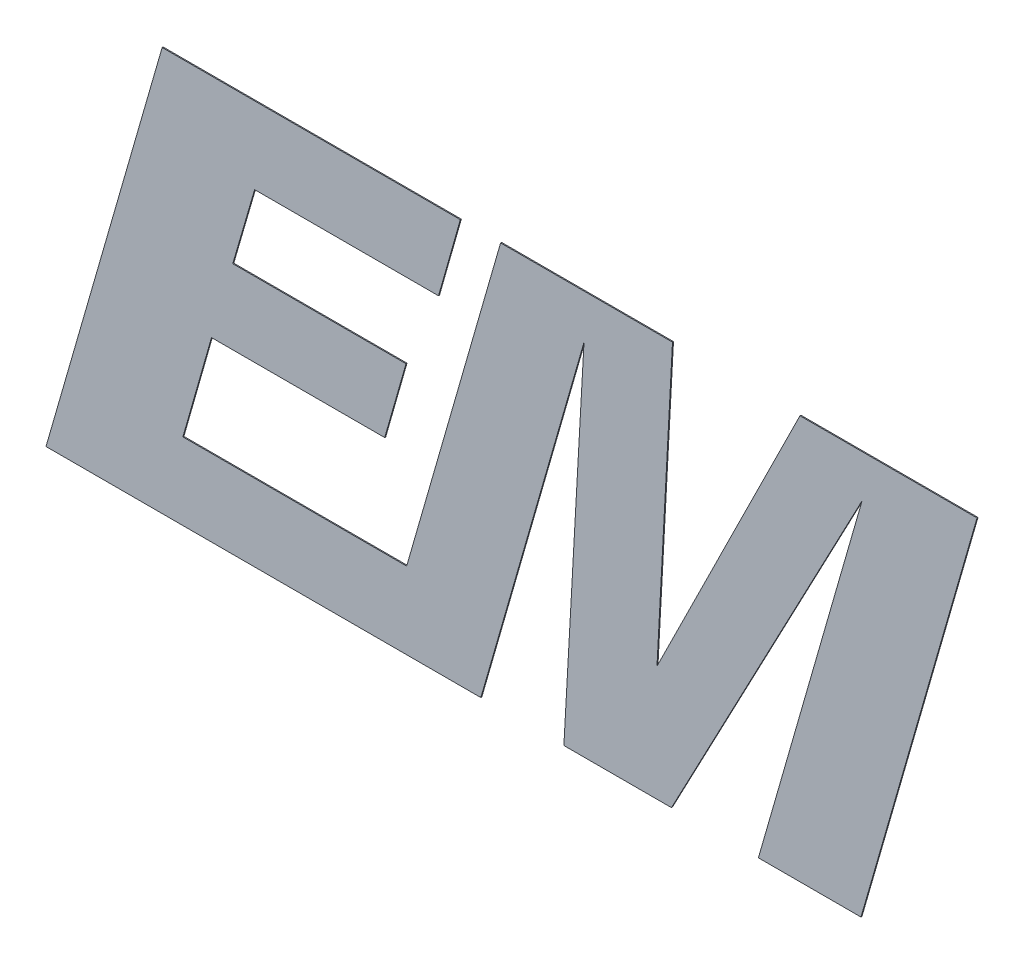
ISO-10303-21;
HEADER;
FILE_DESCRIPTION(('STEP AP214'),'2;1');
FILE_NAME('part.step','',(''),(''),'','','');
FILE_SCHEMA(('AUTOMOTIVE_DESIGN { 1 0 10303 214 1 1 1 1 }'));
ENDSEC;
DATA;
#1=APPLICATION_CONTEXT('core data for automotive mechanical design processes');
#2=APPLICATION_PROTOCOL_DEFINITION('international standard','automotive_design',2000,#1);
#3=PRODUCT_CONTEXT('',#1,'mechanical');
#4=PRODUCT('Part','Part','',(#3));
#5=PRODUCT_RELATED_PRODUCT_CATEGORY('part','',(#4));
#6=PRODUCT_DEFINITION_FORMATION('','',#4);
#7=PRODUCT_DEFINITION_CONTEXT('part definition',#1,'design');
#8=PRODUCT_DEFINITION('design','',#6,#7);
#9=PRODUCT_DEFINITION_SHAPE('','',#8);
#10=(LENGTH_UNIT() NAMED_UNIT(*) SI_UNIT(.MILLI.,.METRE.));
#11=(NAMED_UNIT(*) PLANE_ANGLE_UNIT() SI_UNIT($,.RADIAN.));
#12=(NAMED_UNIT(*) SI_UNIT($,.STERADIAN.) SOLID_ANGLE_UNIT());
#13=UNCERTAINTY_MEASURE_WITH_UNIT(LENGTH_MEASURE(1.E-05),#10,'distance_accuracy_value','');
#14=(GEOMETRIC_REPRESENTATION_CONTEXT(3) GLOBAL_UNCERTAINTY_ASSIGNED_CONTEXT((#13)) GLOBAL_UNIT_ASSIGNED_CONTEXT((#10,
#11,#12)) REPRESENTATION_CONTEXT('',''));
#15=CARTESIAN_POINT('',(0.,0.,0.));
#16=DIRECTION('',(0.,0.,1.));
#17=DIRECTION('',(1.,0.,0.));
#18=AXIS2_PLACEMENT_3D('',#15,#16,#17);
#19=CARTESIAN_POINT('',(10.8469375416372,6.82608440985244,5.205));
#20=DIRECTION('',(0.,-1.,0.));
#21=DIRECTION('',(0.,0.,-1.));
#22=AXIS2_PLACEMENT_3D('',#19,#20,#21);
#23=PLANE('',#22);
#24=DIRECTION('',(-1.,0.,0.));
#25=VECTOR('',#24,1.);
#26=CARTESIAN_POINT('',(10.8469375416372,6.82608440985244,5.2));
#27=LINE('',#26,#25);
#28=CARTESIAN_POINT('',(10.8469375416372,6.82608440985244,5.2));
#29=VERTEX_POINT('',#28);
#30=CARTESIAN_POINT('',(9.94792919842269,6.82608440985244,5.2));
#31=VERTEX_POINT('',#30);
#32=EDGE_CURVE('E11',#29,#31,#27,.T.);
#33=ORIENTED_EDGE('',*,*,#32,.T.);
#34=DIRECTION('',(0.,0.,-1.));
#35=VECTOR('',#34,1.);
#36=CARTESIAN_POINT('',(9.94792919842269,6.82608440985244,5.205));
#37=LINE('',#36,#35);
#38=CARTESIAN_POINT('',(9.94792919842269,6.82608440985244,5.205));
#39=VERTEX_POINT('',#38);
#40=EDGE_CURVE('E43',#39,#31,#37,.T.);
#41=ORIENTED_EDGE('',*,*,#40,.F.);
#42=DIRECTION('',(-1.,0.,0.));
#43=VECTOR('',#42,1.);
#44=CARTESIAN_POINT('',(10.8469375416372,6.82608440985244,5.205));
#45=LINE('',#44,#43);
#46=CARTESIAN_POINT('',(10.8469375416372,6.82608440985244,5.205));
#47=VERTEX_POINT('',#46);
#48=EDGE_CURVE('E352',#47,#39,#45,.T.);
#49=ORIENTED_EDGE('',*,*,#48,.F.);
#50=DIRECTION('',(0.,0.,-1.));
#51=VECTOR('',#50,1.);
#52=CARTESIAN_POINT('',(10.8469375416372,6.82608440985244,5.205));
#53=LINE('',#52,#51);
#54=EDGE_CURVE('E28',#47,#29,#53,.T.);
#55=ORIENTED_EDGE('',*,*,#54,.T.);
#56=EDGE_LOOP('',(#33,#41,#49,#55));
#57=FACE_BOUND('',#56,.T.);
#58=ADVANCED_FACE('F17',(#57),#23,.F.);
#59=CARTESIAN_POINT('',(9.94792919842269,6.82608440985244,5.205));
#60=DIRECTION('',(0.89586763618268,-0.444321030832952,0.));
#61=DIRECTION('',(0.,0.,-1.));
#62=AXIS2_PLACEMENT_3D('',#59,#60,#61);
#63=PLANE('',#62);
#64=DIRECTION('',(-0.444321030832952,-0.89586763618268,0.));
#65=VECTOR('',#64,1.);
#66=CARTESIAN_POINT('',(9.94792919842269,6.82608440985244,5.2));
#67=LINE('',#66,#65);
#68=CARTESIAN_POINT('',(9.22164915934347,5.36171352334091,5.2));
#69=VERTEX_POINT('',#68);
#70=EDGE_CURVE('E250',#31,#69,#67,.T.);
#71=ORIENTED_EDGE('',*,*,#70,.T.);
#72=DIRECTION('',(0.,0.,-1.));
#73=VECTOR('',#72,1.);
#74=CARTESIAN_POINT('',(9.22164915934347,5.36171352334091,5.205));
#75=LINE('',#74,#73);
#76=CARTESIAN_POINT('',(9.22164915934347,5.36171352334091,5.205));
#77=VERTEX_POINT('',#76);
#78=EDGE_CURVE('E228',#77,#69,#75,.T.);
#79=ORIENTED_EDGE('',*,*,#78,.F.);
#80=DIRECTION('',(-0.444321030832952,-0.89586763618268,0.));
#81=VECTOR('',#80,1.);
#82=CARTESIAN_POINT('',(9.94792919842269,6.82608440985244,5.205));
#83=LINE('',#82,#81);
#84=EDGE_CURVE('E202',#39,#77,#83,.T.);
#85=ORIENTED_EDGE('',*,*,#84,.F.);
#86=ORIENTED_EDGE('',*,*,#40,.T.);
#87=EDGE_LOOP('',(#71,#79,#85,#86));
#88=FACE_BOUND('',#87,.T.);
#89=ADVANCED_FACE('F19',(#88),#63,.F.);
#90=CARTESIAN_POINT('',(9.22164915934347,5.36171352334091,5.205));
#91=DIRECTION('',(-0.998554284376095,0.0537525920690858,0.));
#92=DIRECTION('',(0.,0.,1.));
#93=AXIS2_PLACEMENT_3D('',#90,#91,#92);
#94=PLANE('',#93);
#95=DIRECTION('',(0.0537525920690858,0.998554284376095,0.));
#96=VECTOR('',#95,1.);
#97=CARTESIAN_POINT('',(9.22164915934347,5.36171352334091,5.2));
#98=LINE('',#97,#96);
#99=CARTESIAN_POINT('',(9.30047685267181,6.82608440985244,5.2));
#100=VERTEX_POINT('',#99);
#101=EDGE_CURVE('E226',#69,#100,#98,.T.);
#102=ORIENTED_EDGE('',*,*,#101,.T.);
#103=DIRECTION('',(0.,0.,-1.));
#104=VECTOR('',#103,1.);
#105=CARTESIAN_POINT('',(9.30047685267181,6.82608440985244,5.205));
#106=LINE('',#105,#104);
#107=CARTESIAN_POINT('',(9.30047685267181,6.82608440985244,5.205));
#108=VERTEX_POINT('',#107);
#109=EDGE_CURVE('E212',#108,#100,#106,.T.);
#110=ORIENTED_EDGE('',*,*,#109,.F.);
#111=DIRECTION('',(0.0537525920690858,0.998554284376095,0.));
#112=VECTOR('',#111,1.);
#113=CARTESIAN_POINT('',(9.22164915934347,5.36171352334091,5.205));
#114=LINE('',#113,#112);
#115=EDGE_CURVE('E363',#77,#108,#114,.T.);
#116=ORIENTED_EDGE('',*,*,#115,.F.);
#117=ORIENTED_EDGE('',*,*,#78,.T.);
#118=EDGE_LOOP('',(#102,#110,#116,#117));
#119=FACE_BOUND('',#118,.T.);
#120=ADVANCED_FACE('F227',(#119),#94,.F.);
#121=CARTESIAN_POINT('',(9.30047685267181,6.82608440985244,5.205));
#122=DIRECTION('',(0.,-1.,0.));
#123=DIRECTION('',(0.,0.,-1.));
#124=AXIS2_PLACEMENT_3D('',#121,#122,#123);
#125=PLANE('',#124);
#126=DIRECTION('',(-1.,0.,0.));
#127=VECTOR('',#126,1.);
#128=CARTESIAN_POINT('',(9.30047685267181,6.82608440985244,5.2));
#129=LINE('',#128,#127);
#130=CARTESIAN_POINT('',(8.42755896722305,6.82608440985244,5.2));
#131=VERTEX_POINT('',#130);
#132=EDGE_CURVE('E217',#100,#131,#129,.T.);
#133=ORIENTED_EDGE('',*,*,#132,.T.);
#134=DIRECTION('',(0.,0.,-1.));
#135=VECTOR('',#134,1.);
#136=CARTESIAN_POINT('',(8.42755896722305,6.82608440985244,5.205));
#137=LINE('',#136,#135);
#138=CARTESIAN_POINT('',(8.42755896722305,6.82608440985244,5.205));
#139=VERTEX_POINT('',#138);
#140=EDGE_CURVE('E334',#139,#131,#137,.T.);
#141=ORIENTED_EDGE('',*,*,#140,.F.);
#142=DIRECTION('',(-1.,0.,0.));
#143=VECTOR('',#142,1.);
#144=CARTESIAN_POINT('',(9.30047685267181,6.82608440985244,5.205));
#145=LINE('',#144,#143);
#146=EDGE_CURVE('E219',#108,#139,#145,.T.);
#147=ORIENTED_EDGE('',*,*,#146,.F.);
#148=ORIENTED_EDGE('',*,*,#109,.T.);
#149=EDGE_LOOP('',(#133,#141,#147,#148));
#150=FACE_BOUND('',#149,.T.);
#151=ADVANCED_FACE('F214',(#150),#125,.F.);
#152=CARTESIAN_POINT('',(8.42755896722305,6.82608440985244,5.205));
#153=DIRECTION('',(0.961085306551383,-0.276251757516641,0.));
#154=DIRECTION('',(0.,0.,-1.));
#155=AXIS2_PLACEMENT_3D('',#152,#153,#154);
#156=PLANE('',#155);
#157=DIRECTION('',(-0.276251757516641,-0.961085306551383,0.));
#158=VECTOR('',#157,1.);
#159=CARTESIAN_POINT('',(8.42755896722305,6.82608440985244,5.2));
#160=LINE('',#159,#158);
#161=CARTESIAN_POINT('',(7.95047417520321,5.16629701985992,5.2));
#162=VERTEX_POINT('',#161);
#163=EDGE_CURVE('E223',#131,#162,#160,.T.);
#164=ORIENTED_EDGE('',*,*,#163,.T.);
#165=DIRECTION('',(0.,0.,-1.));
#166=VECTOR('',#165,1.);
#167=CARTESIAN_POINT('',(7.95047417520321,5.16629701985992,5.205));
#168=LINE('',#167,#166);
#169=CARTESIAN_POINT('',(7.95047417520321,5.16629701985992,5.205));
#170=VERTEX_POINT('',#169);
#171=EDGE_CURVE('E269',#170,#162,#168,.T.);
#172=ORIENTED_EDGE('',*,*,#171,.F.);
#173=DIRECTION('',(-0.276251757516641,-0.961085306551383,0.));
#174=VECTOR('',#173,1.);
#175=CARTESIAN_POINT('',(8.42755896722305,6.82608440985244,5.205));
#176=LINE('',#175,#174);
#177=EDGE_CURVE('E343',#139,#170,#176,.T.);
#178=ORIENTED_EDGE('',*,*,#177,.F.);
#179=ORIENTED_EDGE('',*,*,#140,.T.);
#180=EDGE_LOOP('',(#164,#172,#178,#179));
#181=FACE_BOUND('',#180,.T.);
#182=ADVANCED_FACE('F550',(#181),#156,.F.);
#183=CARTESIAN_POINT('',(7.95047417520321,5.16629701985992,5.205));
#184=DIRECTION('',(0.,-1.,0.));
#185=DIRECTION('',(0.,0.,-1.));
#186=AXIS2_PLACEMENT_3D('',#183,#184,#185);
#187=PLANE('',#186);
#188=DIRECTION('',(-1.,0.,0.));
#189=VECTOR('',#188,1.);
#190=CARTESIAN_POINT('',(7.95047417520321,5.16629701985992,5.2));
#191=LINE('',#190,#189);
#192=CARTESIAN_POINT('',(6.8142036420702,5.16629701985992,5.2));
#193=VERTEX_POINT('',#192);
#194=EDGE_CURVE('E330',#162,#193,#191,.T.);
#195=ORIENTED_EDGE('',*,*,#194,.T.);
#196=DIRECTION('',(0.,0.,-1.));
#197=VECTOR('',#196,1.);
#198=CARTESIAN_POINT('',(6.8142036420702,5.16629701985992,5.205));
#199=LINE('',#198,#197);
#200=CARTESIAN_POINT('',(6.8142036420702,5.16629701985992,5.205));
#201=VERTEX_POINT('',#200);
#202=EDGE_CURVE('E270',#201,#193,#199,.T.);
#203=ORIENTED_EDGE('',*,*,#202,.F.);
#204=DIRECTION('',(-1.,0.,0.));
#205=VECTOR('',#204,1.);
#206=CARTESIAN_POINT('',(7.95047417520321,5.16629701985992,5.205));
#207=LINE('',#206,#205);
#208=EDGE_CURVE('E340',#170,#201,#207,.T.);
#209=ORIENTED_EDGE('',*,*,#208,.F.);
#210=ORIENTED_EDGE('',*,*,#171,.T.);
#211=EDGE_LOOP('',(#195,#203,#209,#210));
#212=FACE_BOUND('',#211,.T.);
#213=ADVANCED_FACE('F553',(#212),#187,.F.);
#214=CARTESIAN_POINT('',(6.8142036420702,5.16629701985992,5.205));
#215=DIRECTION('',(-0.96172348726206,0.274021776595407,0.));
#216=DIRECTION('',(0.,0.,1.));
#217=AXIS2_PLACEMENT_3D('',#214,#215,#216);
#218=PLANE('',#217);
#219=DIRECTION('',(0.274021776595406,0.96172348726206,0.));
#220=VECTOR('',#219,1.);
#221=CARTESIAN_POINT('',(6.8142036420702,5.16629701985992,5.2));
#222=LINE('',#221,#220);
#223=CARTESIAN_POINT('',(6.9593583790476,5.6757409099513,5.2));
#224=VERTEX_POINT('',#223);
#225=EDGE_CURVE('E265',#193,#224,#222,.T.);
#226=ORIENTED_EDGE('',*,*,#225,.T.);
#227=DIRECTION('',(0.,0.,-1.));
#228=VECTOR('',#227,1.);
#229=CARTESIAN_POINT('',(6.9593583790476,5.6757409099513,5.205));
#230=LINE('',#229,#228);
#231=CARTESIAN_POINT('',(6.9593583790476,5.6757409099513,5.205));
#232=VERTEX_POINT('',#231);
#233=EDGE_CURVE('E279',#232,#224,#230,.T.);
#234=ORIENTED_EDGE('',*,*,#233,.F.);
#235=DIRECTION('',(0.274021776595406,0.96172348726206,0.));
#236=VECTOR('',#235,1.);
#237=CARTESIAN_POINT('',(6.8142036420702,5.16629701985992,5.205));
#238=LINE('',#237,#236);
#239=EDGE_CURVE('E344',#201,#232,#238,.T.);
#240=ORIENTED_EDGE('',*,*,#239,.F.);
#241=ORIENTED_EDGE('',*,*,#202,.T.);
#242=EDGE_LOOP('',(#226,#234,#240,#241));
#243=FACE_BOUND('',#242,.T.);
#244=ADVANCED_FACE('F526',(#243),#218,.F.);
#245=CARTESIAN_POINT('',(6.9593583790476,5.6757409099513,5.205));
#246=DIRECTION('',(0.,1.,0.));
#247=DIRECTION('',(1.,0.,0.));
#248=AXIS2_PLACEMENT_3D('',#245,#246,#247);
#249=PLANE('',#248);
#250=DIRECTION('',(1.,0.,0.));
#251=VECTOR('',#250,1.);
#252=CARTESIAN_POINT('',(6.9593583790476,5.6757409099513,5.2));
#253=LINE('',#252,#251);
#254=CARTESIAN_POINT('',(7.83901228958873,5.6757409099513,5.2));
#255=VERTEX_POINT('',#254);
#256=EDGE_CURVE('E326',#224,#255,#253,.T.);
#257=ORIENTED_EDGE('',*,*,#256,.T.);
#258=DIRECTION('',(0.,0.,-1.));
#259=VECTOR('',#258,1.);
#260=CARTESIAN_POINT('',(7.83901228958873,5.6757409099513,5.205));
#261=LINE('',#260,#259);
#262=CARTESIAN_POINT('',(7.83901228958873,5.6757409099513,5.205));
#263=VERTEX_POINT('',#262);
#264=EDGE_CURVE('E280',#263,#255,#261,.T.);
#265=ORIENTED_EDGE('',*,*,#264,.F.);
#266=DIRECTION('',(1.,0.,0.));
#267=VECTOR('',#266,1.);
#268=CARTESIAN_POINT('',(6.9593583790476,5.6757409099513,5.205));
#269=LINE('',#268,#267);
#270=EDGE_CURVE('E371',#232,#263,#269,.T.);
#271=ORIENTED_EDGE('',*,*,#270,.F.);
#272=ORIENTED_EDGE('',*,*,#233,.T.);
#273=EDGE_LOOP('',(#257,#265,#271,#272));
#274=FACE_BOUND('',#273,.T.);
#275=ADVANCED_FACE('F530',(#274),#249,.F.);
#276=CARTESIAN_POINT('',(7.83901228958873,5.6757409099513,5.205));
#277=DIRECTION('',(-0.961545429433448,0.27464593049169,0.));
#278=DIRECTION('',(0.,0.,1.));
#279=AXIS2_PLACEMENT_3D('',#276,#277,#278);
#280=PLANE('',#279);
#281=DIRECTION('',(0.27464593049169,0.961545429433448,0.));
#282=VECTOR('',#281,1.);
#283=CARTESIAN_POINT('',(7.83901228958873,5.6757409099513,5.2));
#284=LINE('',#283,#282);
#285=CARTESIAN_POINT('',(7.94724574439114,6.05467018660481,5.2));
#286=VERTEX_POINT('',#285);
#287=EDGE_CURVE('E276',#255,#286,#284,.T.);
#288=ORIENTED_EDGE('',*,*,#287,.T.);
#289=DIRECTION('',(0.,0.,-1.));
#290=VECTOR('',#289,1.);
#291=CARTESIAN_POINT('',(7.94724574439114,6.05467018660481,5.205));
#292=LINE('',#291,#290);
#293=CARTESIAN_POINT('',(7.94724574439114,6.05467018660481,5.205));
#294=VERTEX_POINT('',#293);
#295=EDGE_CURVE('E299',#294,#286,#292,.T.);
#296=ORIENTED_EDGE('',*,*,#295,.F.);
#297=DIRECTION('',(0.27464593049169,0.961545429433448,0.));
#298=VECTOR('',#297,1.);
#299=CARTESIAN_POINT('',(7.83901228958873,5.6757409099513,5.205));
#300=LINE('',#299,#298);
#301=EDGE_CURVE('E348',#263,#294,#300,.T.);
#302=ORIENTED_EDGE('',*,*,#301,.F.);
#303=ORIENTED_EDGE('',*,*,#264,.T.);
#304=EDGE_LOOP('',(#288,#296,#302,#303));
#305=FACE_BOUND('',#304,.T.);
#306=ADVANCED_FACE('F535',(#305),#280,.F.);
#307=CARTESIAN_POINT('',(7.94724574439114,6.05467018660481,5.205));
#308=DIRECTION('',(0.,-1.,0.));
#309=DIRECTION('',(0.,0.,-1.));
#310=AXIS2_PLACEMENT_3D('',#307,#308,#309);
#311=PLANE('',#310);
#312=DIRECTION('',(-1.,0.,0.));
#313=VECTOR('',#312,1.);
#314=CARTESIAN_POINT('',(7.94724574439114,6.05467018660481,5.2));
#315=LINE('',#314,#313);
#316=CARTESIAN_POINT('',(7.06746718401157,6.05467018660481,5.2));
#317=VERTEX_POINT('',#316);
#318=EDGE_CURVE('E320',#286,#317,#315,.T.);
#319=ORIENTED_EDGE('',*,*,#318,.T.);
#320=DIRECTION('',(0.,0.,-1.));
#321=VECTOR('',#320,1.);
#322=CARTESIAN_POINT('',(7.06746718401157,6.05467018660481,5.205));
#323=LINE('',#322,#321);
#324=CARTESIAN_POINT('',(7.06746718401157,6.05467018660481,5.205));
#325=VERTEX_POINT('',#324);
#326=EDGE_CURVE('E21',#325,#317,#323,.T.);
#327=ORIENTED_EDGE('',*,*,#326,.F.);
#328=DIRECTION('',(-1.,0.,0.));
#329=VECTOR('',#328,1.);
#330=CARTESIAN_POINT('',(7.94724574439114,6.05467018660481,5.205));
#331=LINE('',#330,#329);
#332=EDGE_CURVE('E313',#294,#325,#331,.T.);
#333=ORIENTED_EDGE('',*,*,#332,.F.);
#334=ORIENTED_EDGE('',*,*,#295,.T.);
#335=EDGE_LOOP('',(#319,#327,#333,#334));
#336=FACE_BOUND('',#335,.T.);
#337=ADVANCED_FACE('F538',(#336),#311,.F.);
#338=CARTESIAN_POINT('',(7.06746718401157,6.05467018660481,5.205));
#339=DIRECTION('',(-0.960176311432759,0.27939479408783,0.));
#340=DIRECTION('',(0.,0.,1.));
#341=AXIS2_PLACEMENT_3D('',#338,#339,#340);
#342=PLANE('',#341);
#343=DIRECTION('',(0.27939479408783,0.960176311432759,0.));
#344=VECTOR('',#343,1.);
#345=CARTESIAN_POINT('',(7.06746718401157,6.05467018660481,5.2));
#346=LINE('',#345,#344);
#347=CARTESIAN_POINT('',(7.17840554031016,6.43592418274659,5.2));
#348=VERTEX_POINT('',#347);
#349=EDGE_CURVE('E295',#317,#348,#346,.T.);
#350=ORIENTED_EDGE('',*,*,#349,.T.);
#351=DIRECTION('',(0.,0.,-1.));
#352=VECTOR('',#351,1.);
#353=CARTESIAN_POINT('',(7.17840554031016,6.43592418274659,5.205));
#354=LINE('',#353,#352);
#355=CARTESIAN_POINT('',(7.17840554031016,6.43592418274659,5.205));
#356=VERTEX_POINT('',#355);
#357=EDGE_CURVE('E247',#356,#348,#354,.T.);
#358=ORIENTED_EDGE('',*,*,#357,.F.);
#359=DIRECTION('',(0.27939479408783,0.960176311432759,0.));
#360=VECTOR('',#359,1.);
#361=CARTESIAN_POINT('',(7.06746718401157,6.05467018660481,5.205));
#362=LINE('',#361,#360);
#363=EDGE_CURVE('E310',#325,#356,#362,.T.);
#364=ORIENTED_EDGE('',*,*,#363,.F.);
#365=ORIENTED_EDGE('',*,*,#326,.T.);
#366=EDGE_LOOP('',(#350,#358,#364,#365));
#367=FACE_BOUND('',#366,.T.);
#368=ADVANCED_FACE('F417',(#367),#342,.F.);
#369=CARTESIAN_POINT('',(7.17840554031016,6.43592418274659,5.205));
#370=DIRECTION('',(0.,1.,0.));
#371=DIRECTION('',(1.,0.,0.));
#372=AXIS2_PLACEMENT_3D('',#369,#370,#371);
#373=PLANE('',#372);
#374=DIRECTION('',(1.,0.,0.));
#375=VECTOR('',#374,1.);
#376=CARTESIAN_POINT('',(7.17840554031016,6.43592418274659,5.2));
#377=LINE('',#376,#375);
#378=CARTESIAN_POINT('',(8.11229459559777,6.43592418274659,5.2));
#379=VERTEX_POINT('',#378);
#380=EDGE_CURVE('E397',#348,#379,#377,.T.);
#381=ORIENTED_EDGE('',*,*,#380,.T.);
#382=DIRECTION('',(0.,0.,-1.));
#383=VECTOR('',#382,1.);
#384=CARTESIAN_POINT('',(8.11229459559777,6.43592418274659,5.205));
#385=LINE('',#384,#383);
#386=CARTESIAN_POINT('',(8.11229459559777,6.43592418274659,5.205));
#387=VERTEX_POINT('',#386);
#388=EDGE_CURVE('E260',#387,#379,#385,.T.);
#389=ORIENTED_EDGE('',*,*,#388,.F.);
#390=DIRECTION('',(1.,0.,0.));
#391=VECTOR('',#390,1.);
#392=CARTESIAN_POINT('',(7.17840554031016,6.43592418274659,5.205));
#393=LINE('',#392,#391);
#394=EDGE_CURVE('E314',#356,#387,#393,.T.);
#395=ORIENTED_EDGE('',*,*,#394,.F.);
#396=ORIENTED_EDGE('',*,*,#357,.T.);
#397=EDGE_LOOP('',(#381,#389,#395,#396));
#398=FACE_BOUND('',#397,.T.);
#399=ADVANCED_FACE('F412',(#398),#373,.F.);
#400=CARTESIAN_POINT('',(8.11229459559777,6.43592418274659,5.205));
#401=DIRECTION('',(-0.961953028041548,0.273214882174628,0.));
#402=DIRECTION('',(0.,0.,1.));
#403=AXIS2_PLACEMENT_3D('',#400,#401,#402);
#404=PLANE('',#403);
#405=DIRECTION('',(0.273214882174629,0.961953028041548,0.));
#406=VECTOR('',#405,1.);
#407=CARTESIAN_POINT('',(8.11229459559777,6.43592418274659,5.2));
#408=LINE('',#407,#406);
#409=CARTESIAN_POINT('',(8.22310830205803,6.82608440985244,5.2));
#410=VERTEX_POINT('',#409);
#411=EDGE_CURVE('E256',#379,#410,#408,.T.);
#412=ORIENTED_EDGE('',*,*,#411,.T.);
#413=DIRECTION('',(0.,0.,-1.));
#414=VECTOR('',#413,1.);
#415=CARTESIAN_POINT('',(8.22310830205803,6.82608440985244,5.205));
#416=LINE('',#415,#414);
#417=CARTESIAN_POINT('',(8.22310830205803,6.82608440985244,5.205));
#418=VERTEX_POINT('',#417);
#419=EDGE_CURVE('E428',#418,#410,#416,.T.);
#420=ORIENTED_EDGE('',*,*,#419,.F.);
#421=DIRECTION('',(0.273214882174629,0.961953028041548,0.));
#422=VECTOR('',#421,1.);
#423=CARTESIAN_POINT('',(8.11229459559777,6.43592418274659,5.205));
#424=LINE('',#423,#422);
#425=EDGE_CURVE('E335',#387,#418,#424,.T.);
#426=ORIENTED_EDGE('',*,*,#425,.F.);
#427=ORIENTED_EDGE('',*,*,#388,.T.);
#428=EDGE_LOOP('',(#412,#420,#426,#427));
#429=FACE_BOUND('',#428,.T.);
#430=ADVANCED_FACE('F426',(#429),#404,.F.);
#431=CARTESIAN_POINT('',(8.22310830205803,6.82608440985244,5.205));
#432=DIRECTION('',(0.,-1.,0.));
#433=DIRECTION('',(0.,0.,-1.));
#434=AXIS2_PLACEMENT_3D('',#431,#432,#433);
#435=PLANE('',#434);
#436=DIRECTION('',(-1.,0.,0.));
#437=VECTOR('',#436,1.);
#438=CARTESIAN_POINT('',(8.22310830205803,6.82608440985244,5.2));
#439=LINE('',#438,#437);
#440=CARTESIAN_POINT('',(6.70881843609201,6.82608440985244,5.2));
#441=VERTEX_POINT('',#440);
#442=EDGE_CURVE('E381',#410,#441,#439,.T.);
#443=ORIENTED_EDGE('',*,*,#442,.T.);
#444=DIRECTION('',(0.,0.,-1.));
#445=VECTOR('',#444,1.);
#446=CARTESIAN_POINT('',(6.70881843609201,6.82608440985244,5.205));
#447=LINE('',#446,#445);
#448=CARTESIAN_POINT('',(6.70881843609201,6.82608440985244,5.205));
#449=VERTEX_POINT('',#448);
#450=EDGE_CURVE('E504',#449,#441,#447,.T.);
#451=ORIENTED_EDGE('',*,*,#450,.F.);
#452=DIRECTION('',(-1.,0.,0.));
#453=VECTOR('',#452,1.);
#454=CARTESIAN_POINT('',(8.22310830205803,6.82608440985244,5.205));
#455=LINE('',#454,#453);
#456=EDGE_CURVE('E308',#418,#449,#455,.T.);
#457=ORIENTED_EDGE('',*,*,#456,.F.);
#458=ORIENTED_EDGE('',*,*,#419,.T.);
#459=EDGE_LOOP('',(#443,#451,#457,#458));
#460=FACE_BOUND('',#459,.T.);
#461=ADVANCED_FACE('F645',(#460),#435,.F.);
#462=CARTESIAN_POINT('',(6.70881843609201,6.82608440985244,5.205));
#463=DIRECTION('',(0.961002990822128,-0.276537975024996,0.));
#464=DIRECTION('',(0.,0.,-1.));
#465=AXIS2_PLACEMENT_3D('',#462,#463,#464);
#466=PLANE('',#465);
#467=DIRECTION('',(-0.276537975024996,-0.961002990822128,0.));
#468=VECTOR('',#467,1.);
#469=CARTESIAN_POINT('',(6.70881843609201,6.82608440985244,5.2));
#470=LINE('',#469,#468);
#471=CARTESIAN_POINT('',(6.11898163099086,4.77632999999994,5.2));
#472=VERTEX_POINT('',#471);
#473=EDGE_CURVE('E449',#441,#472,#470,.T.);
#474=ORIENTED_EDGE('',*,*,#473,.T.);
#475=DIRECTION('',(0.,0.,-1.));
#476=VECTOR('',#475,1.);
#477=CARTESIAN_POINT('',(6.11898163099086,4.77632999999994,5.205));
#478=LINE('',#477,#476);
#479=CARTESIAN_POINT('',(6.11898163099086,4.77632999999994,5.205));
#480=VERTEX_POINT('',#479);
#481=EDGE_CURVE('E271',#480,#472,#478,.T.);
#482=ORIENTED_EDGE('',*,*,#481,.F.);
#483=DIRECTION('',(-0.276537975024996,-0.961002990822128,0.));
#484=VECTOR('',#483,1.);
#485=CARTESIAN_POINT('',(6.70881843609201,6.82608440985244,5.205));
#486=LINE('',#485,#484);
#487=EDGE_CURVE('E304',#449,#480,#486,.T.);
#488=ORIENTED_EDGE('',*,*,#487,.F.);
#489=ORIENTED_EDGE('',*,*,#450,.T.);
#490=EDGE_LOOP('',(#474,#482,#488,#489));
#491=FACE_BOUND('',#490,.T.);
#492=ADVANCED_FACE('F448',(#491),#466,.F.);
#493=CARTESIAN_POINT('',(7.96234707068914,4.77632999999994,5.205));
#494=DIRECTION('',(0.,1.,0.));
#495=DIRECTION('',(1.,0.,0.));
#496=AXIS2_PLACEMENT_3D('',#493,#494,#495);
#497=PLANE('',#496);
#498=DIRECTION('',(1.,0.,0.));
#499=VECTOR('',#498,1.);
#500=CARTESIAN_POINT('',(7.96234707068914,4.77632999999994,5.2));
#501=LINE('',#500,#499);
#502=CARTESIAN_POINT('',(8.32719714808094,4.77632999999994,5.2));
#503=VERTEX_POINT('',#502);
#504=EDGE_CURVE('E274',#472,#503,#501,.T.);
#505=ORIENTED_EDGE('',*,*,#504,.T.);
#506=DIRECTION('',(0.,0.,-1.));
#507=VECTOR('',#506,1.);
#508=CARTESIAN_POINT('',(8.32719714808094,4.77632999999994,5.205));
#509=LINE('',#508,#507);
#510=CARTESIAN_POINT('',(8.32719714808094,4.77632999999994,5.205));
#511=VERTEX_POINT('',#510);
#512=EDGE_CURVE('E282',#511,#503,#509,.T.);
#513=ORIENTED_EDGE('',*,*,#512,.F.);
#514=DIRECTION('',(1.,0.,0.));
#515=VECTOR('',#514,1.);
#516=CARTESIAN_POINT('',(6.11898163099086,4.77632999999994,5.205));
#517=LINE('',#516,#515);
#518=EDGE_CURVE('E309',#480,#511,#517,.T.);
#519=ORIENTED_EDGE('',*,*,#518,.F.);
#520=ORIENTED_EDGE('',*,*,#481,.T.);
#521=EDGE_LOOP('',(#505,#513,#519,#520));
#522=FACE_BOUND('',#521,.T.);
#523=ADVANCED_FACE('F453',(#522),#497,.F.);
#524=CARTESIAN_POINT('',(8.32719714808094,4.77632999999994,5.205));
#525=DIRECTION('',(-0.961163884540897,0.27597823655907,0.));
#526=DIRECTION('',(0.,0.,1.));
#527=AXIS2_PLACEMENT_3D('',#524,#525,#526);
#528=PLANE('',#527);
#529=DIRECTION('',(0.27597823655907,0.961163884540897,0.));
#530=VECTOR('',#529,1.);
#531=CARTESIAN_POINT('',(8.32719714808094,4.77632999999994,5.2));
#532=LINE('',#531,#530);
#533=CARTESIAN_POINT('',(8.85116274436316,6.60117247369481,5.2));
#534=VERTEX_POINT('',#533);
#535=EDGE_CURVE('E275',#503,#534,#532,.T.);
#536=ORIENTED_EDGE('',*,*,#535,.T.);
#537=DIRECTION('',(0.,0.,-1.));
#538=VECTOR('',#537,1.);
#539=CARTESIAN_POINT('',(8.85116274436316,6.60117247369481,5.205));
#540=LINE('',#539,#538);
#541=CARTESIAN_POINT('',(8.85116274436316,6.60117247369481,5.205));
#542=VERTEX_POINT('',#541);
#543=EDGE_CURVE('E325',#542,#534,#540,.T.);
#544=ORIENTED_EDGE('',*,*,#543,.F.);
#545=DIRECTION('',(0.27597823655907,0.961163884540897,0.));
#546=VECTOR('',#545,1.);
#547=CARTESIAN_POINT('',(8.32719714808094,4.77632999999994,5.205));
#548=LINE('',#547,#546);
#549=EDGE_CURVE('E317',#511,#542,#548,.T.);
#550=ORIENTED_EDGE('',*,*,#549,.F.);
#551=ORIENTED_EDGE('',*,*,#512,.T.);
#552=EDGE_LOOP('',(#536,#544,#550,#551));
#553=FACE_BOUND('',#552,.T.);
#554=ADVANCED_FACE('F459',(#553),#528,.F.);
#555=CARTESIAN_POINT('',(8.85116274436316,6.60117247369481,5.205));
#556=DIRECTION('',(0.998432730113024,-0.0559650197806937,0.));
#557=DIRECTION('',(0.,0.,-1.));
#558=AXIS2_PLACEMENT_3D('',#555,#556,#557);
#559=PLANE('',#558);
#560=DIRECTION('',(-0.0559650197806937,-0.998432730113024,0.));
#561=VECTOR('',#560,1.);
#562=CARTESIAN_POINT('',(8.85116274436316,6.60117247369481,5.2));
#563=LINE('',#562,#561);
#564=CARTESIAN_POINT('',(8.74887508686076,4.77632999999994,5.2));
#565=VERTEX_POINT('',#564);
#566=EDGE_CURVE('E285',#534,#565,#563,.T.);
#567=ORIENTED_EDGE('',*,*,#566,.T.);
#568=DIRECTION('',(0.,0.,-1.));
#569=VECTOR('',#568,1.);
#570=CARTESIAN_POINT('',(8.74887508686076,4.77632999999994,5.205));
#571=LINE('',#570,#569);
#572=CARTESIAN_POINT('',(8.74887508686076,4.77632999999994,5.205));
#573=VERTEX_POINT('',#572);
#574=EDGE_CURVE('E289',#573,#565,#571,.T.);
#575=ORIENTED_EDGE('',*,*,#574,.F.);
#576=DIRECTION('',(-0.0559650197806937,-0.998432730113024,0.));
#577=VECTOR('',#576,1.);
#578=CARTESIAN_POINT('',(8.85116274436316,6.60117247369481,5.205));
#579=LINE('',#578,#577);
#580=EDGE_CURVE('E355',#542,#573,#579,.T.);
#581=ORIENTED_EDGE('',*,*,#580,.F.);
#582=ORIENTED_EDGE('',*,*,#543,.T.);
#583=EDGE_LOOP('',(#567,#575,#581,#582));
#584=FACE_BOUND('',#583,.T.);
#585=ADVANCED_FACE('F470',(#584),#559,.F.);
#586=CARTESIAN_POINT('',(8.74887508686076,4.77632999999994,5.205));
#587=DIRECTION('',(0.,1.,0.));
#588=DIRECTION('',(1.,0.,0.));
#589=AXIS2_PLACEMENT_3D('',#586,#587,#588);
#590=PLANE('',#589);
#591=DIRECTION('',(1.,0.,0.));
#592=VECTOR('',#591,1.);
#593=CARTESIAN_POINT('',(8.74887508686076,4.77632999999994,5.2));
#594=LINE('',#593,#592);
#595=CARTESIAN_POINT('',(9.29532128152222,4.77632999999994,5.2));
#596=VERTEX_POINT('',#595);
#597=EDGE_CURVE('E321',#565,#596,#594,.T.);
#598=ORIENTED_EDGE('',*,*,#597,.T.);
#599=DIRECTION('',(0.,0.,-1.));
#600=VECTOR('',#599,1.);
#601=CARTESIAN_POINT('',(9.29532128152222,4.77632999999994,5.205));
#602=LINE('',#601,#600);
#603=CARTESIAN_POINT('',(9.29532128152222,4.77632999999994,5.205));
#604=VERTEX_POINT('',#603);
#605=EDGE_CURVE('E261',#604,#596,#602,.T.);
#606=ORIENTED_EDGE('',*,*,#605,.F.);
#607=DIRECTION('',(1.,0.,0.));
#608=VECTOR('',#607,1.);
#609=CARTESIAN_POINT('',(8.74887508686076,4.77632999999994,5.205));
#610=LINE('',#609,#608);
#611=EDGE_CURVE('E382',#573,#604,#610,.T.);
#612=ORIENTED_EDGE('',*,*,#611,.F.);
#613=ORIENTED_EDGE('',*,*,#574,.T.);
#614=EDGE_LOOP('',(#598,#606,#612,#613));
#615=FACE_BOUND('',#614,.T.);
#616=ADVANCED_FACE('F476',(#615),#590,.F.);
#617=CARTESIAN_POINT('',(9.29532128152222,4.77632999999994,5.205));
#618=DIRECTION('',(-0.884338666563768,0.466845930495508,0.));
#619=DIRECTION('',(0.,0.,1.));
#620=AXIS2_PLACEMENT_3D('',#617,#618,#619);
#621=PLANE('',#620);
#622=DIRECTION('',(0.466845930495508,0.884338666563768,0.));
#623=VECTOR('',#622,1.);
#624=CARTESIAN_POINT('',(9.29532128152222,4.77632999999994,5.2));
#625=LINE('',#624,#623);
#626=CARTESIAN_POINT('',(10.2633020676491,6.60996028730735,5.2));
#627=VERTEX_POINT('',#626);
#628=EDGE_CURVE('E264',#596,#627,#625,.T.);
#629=ORIENTED_EDGE('',*,*,#628,.T.);
#630=DIRECTION('',(0.,0.,-1.));
#631=VECTOR('',#630,1.);
#632=CARTESIAN_POINT('',(10.2633020676491,6.60996028730735,5.205));
#633=LINE('',#632,#631);
#634=CARTESIAN_POINT('',(10.2633020676491,6.60996028730735,5.205));
#635=VERTEX_POINT('',#634);
#636=EDGE_CURVE('E251',#635,#627,#633,.T.);
#637=ORIENTED_EDGE('',*,*,#636,.F.);
#638=DIRECTION('',(0.466845930495508,0.884338666563768,0.));
#639=VECTOR('',#638,1.);
#640=CARTESIAN_POINT('',(9.29532128152222,4.77632999999994,5.205));
#641=LINE('',#640,#639);
#642=EDGE_CURVE('E386',#604,#635,#641,.T.);
#643=ORIENTED_EDGE('',*,*,#642,.F.);
#644=ORIENTED_EDGE('',*,*,#605,.T.);
#645=EDGE_LOOP('',(#629,#637,#643,#644));
#646=FACE_BOUND('',#645,.T.);
#647=ADVANCED_FACE('F481',(#646),#621,.F.);
#648=CARTESIAN_POINT('',(10.2633020676491,6.60996028730735,5.205));
#649=DIRECTION('',(0.961154223343868,-0.276011881896858,0.));
#650=DIRECTION('',(0.,0.,-1.));
#651=AXIS2_PLACEMENT_3D('',#648,#649,#650);
#652=PLANE('',#651);
#653=DIRECTION('',(-0.276011881896858,-0.961154223343868,0.));
#654=VECTOR('',#653,1.);
#655=CARTESIAN_POINT('',(10.2633020676491,6.60996028730735,5.2));
#656=LINE('',#655,#654);
#657=CARTESIAN_POINT('',(9.73674375472605,4.77632999999994,5.2));
#658=VERTEX_POINT('',#657);
#659=EDGE_CURVE('E254',#627,#658,#656,.T.);
#660=ORIENTED_EDGE('',*,*,#659,.T.);
#661=DIRECTION('',(0.,0.,-1.));
#662=VECTOR('',#661,1.);
#663=CARTESIAN_POINT('',(9.73674375472605,4.77632999999994,5.205));
#664=LINE('',#663,#662);
#665=CARTESIAN_POINT('',(9.73674375472605,4.77632999999994,5.205));
#666=VERTEX_POINT('',#665);
#667=EDGE_CURVE('E300',#666,#658,#664,.T.);
#668=ORIENTED_EDGE('',*,*,#667,.F.);
#669=DIRECTION('',(-0.276011881896858,-0.961154223343868,0.));
#670=VECTOR('',#669,1.);
#671=CARTESIAN_POINT('',(10.2633020676491,6.60996028730735,5.205));
#672=LINE('',#671,#670);
#673=EDGE_CURVE('E360',#635,#666,#672,.T.);
#674=ORIENTED_EDGE('',*,*,#673,.F.);
#675=ORIENTED_EDGE('',*,*,#636,.T.);
#676=EDGE_LOOP('',(#660,#668,#674,#675));
#677=FACE_BOUND('',#676,.T.);
#678=ADVANCED_FACE('F616',(#677),#652,.F.);
#679=CARTESIAN_POINT('',(9.73674375472605,4.77632999999994,5.205));
#680=DIRECTION('',(0.,1.,0.));
#681=DIRECTION('',(1.,0.,0.));
#682=AXIS2_PLACEMENT_3D('',#679,#680,#681);
#683=PLANE('',#682);
#684=DIRECTION('',(1.,0.,0.));
#685=VECTOR('',#684,1.);
#686=CARTESIAN_POINT('',(9.73674375472605,4.77632999999994,5.2));
#687=LINE('',#686,#685);
#688=CARTESIAN_POINT('',(10.257618035012,4.77632999999994,5.2));
#689=VERTEX_POINT('',#688);
#690=EDGE_CURVE('E255',#658,#689,#687,.T.);
#691=ORIENTED_EDGE('',*,*,#690,.T.);
#692=DIRECTION('',(0.,0.,-1.));
#693=VECTOR('',#692,1.);
#694=CARTESIAN_POINT('',(10.257618035012,4.77632999999994,5.205));
#695=LINE('',#694,#693);
#696=CARTESIAN_POINT('',(10.257618035012,4.77632999999994,5.205));
#697=VERTEX_POINT('',#696);
#698=EDGE_CURVE('E349',#697,#689,#695,.T.);
#699=ORIENTED_EDGE('',*,*,#698,.F.);
#700=DIRECTION('',(1.,0.,0.));
#701=VECTOR('',#700,1.);
#702=CARTESIAN_POINT('',(9.73674375472605,4.77632999999994,5.205));
#703=LINE('',#702,#701);
#704=EDGE_CURVE('E294',#666,#697,#703,.T.);
#705=ORIENTED_EDGE('',*,*,#704,.F.);
#706=ORIENTED_EDGE('',*,*,#667,.T.);
#707=EDGE_LOOP('',(#691,#699,#705,#706));
#708=FACE_BOUND('',#707,.T.);
#709=ADVANCED_FACE('F621',(#708),#683,.F.);
#710=CARTESIAN_POINT('',(10.257618035012,4.77632999999994,5.205));
#711=DIRECTION('',(-0.961067422110707,0.276313970253912,0.));
#712=DIRECTION('',(0.,0.,1.));
#713=AXIS2_PLACEMENT_3D('',#710,#711,#712);
#714=PLANE('',#713);
#715=DIRECTION('',(0.276313970253912,0.961067422110707,0.));
#716=VECTOR('',#715,1.);
#717=CARTESIAN_POINT('',(10.257618035012,4.77632999999994,5.2));
#718=LINE('',#717,#716);
#719=EDGE_CURVE('E303',#689,#29,#718,.T.);
#720=ORIENTED_EDGE('',*,*,#719,.T.);
#721=ORIENTED_EDGE('',*,*,#54,.F.);
#722=DIRECTION('',(0.276313970253912,0.961067422110707,0.));
#723=VECTOR('',#722,1.);
#724=CARTESIAN_POINT('',(10.257618035012,4.77632999999994,5.205));
#725=LINE('',#724,#723);
#726=EDGE_CURVE('E290',#697,#47,#725,.T.);
#727=ORIENTED_EDGE('',*,*,#726,.F.);
#728=ORIENTED_EDGE('',*,*,#698,.T.);
#729=EDGE_LOOP('',(#720,#721,#727,#728));
#730=FACE_BOUND('',#729,.T.);
#731=ADVANCED_FACE('F625',(#730),#714,.F.);
#732=CARTESIAN_POINT('',(-0.222484440430861,-1.85805867567166,5.205));
#733=DIRECTION('',(0.,0.,-1.));
#734=DIRECTION('',(0.,-1.,0.));
#735=AXIS2_PLACEMENT_3D('',#732,#733,#734);
#736=PLANE('',#735);
#737=ORIENTED_EDGE('',*,*,#48,.T.);
#738=ORIENTED_EDGE('',*,*,#84,.T.);
#739=ORIENTED_EDGE('',*,*,#115,.T.);
#740=ORIENTED_EDGE('',*,*,#146,.T.);
#741=ORIENTED_EDGE('',*,*,#177,.T.);
#742=ORIENTED_EDGE('',*,*,#208,.T.);
#743=ORIENTED_EDGE('',*,*,#239,.T.);
#744=ORIENTED_EDGE('',*,*,#270,.T.);
#745=ORIENTED_EDGE('',*,*,#301,.T.);
#746=ORIENTED_EDGE('',*,*,#332,.T.);
#747=ORIENTED_EDGE('',*,*,#363,.T.);
#748=ORIENTED_EDGE('',*,*,#394,.T.);
#749=ORIENTED_EDGE('',*,*,#425,.T.);
#750=ORIENTED_EDGE('',*,*,#456,.T.);
#751=ORIENTED_EDGE('',*,*,#487,.T.);
#752=ORIENTED_EDGE('',*,*,#518,.T.);
#753=ORIENTED_EDGE('',*,*,#549,.T.);
#754=ORIENTED_EDGE('',*,*,#580,.T.);
#755=ORIENTED_EDGE('',*,*,#611,.T.);
#756=ORIENTED_EDGE('',*,*,#642,.T.);
#757=ORIENTED_EDGE('',*,*,#673,.T.);
#758=ORIENTED_EDGE('',*,*,#704,.T.);
#759=ORIENTED_EDGE('',*,*,#726,.T.);
#760=EDGE_LOOP('',(#737,#738,#739,#740,#741,#742,#743,#744,#745,#746,#747,#748,#749,#750,#751,
#752,#753,#754,#755,#756,#757,#758,#759));
#761=FACE_BOUND('',#760,.T.);
#762=ADVANCED_FACE('F442',(#761),#736,.F.);
#763=CARTESIAN_POINT('',(-0.222484440430861,-1.85805867567166,5.2));
#764=DIRECTION('',(0.,0.,-1.));
#765=DIRECTION('',(0.,-1.,0.));
#766=AXIS2_PLACEMENT_3D('',#763,#764,#765);
#767=PLANE('',#766);
#768=ORIENTED_EDGE('',*,*,#32,.F.);
#769=ORIENTED_EDGE('',*,*,#719,.F.);
#770=ORIENTED_EDGE('',*,*,#690,.F.);
#771=ORIENTED_EDGE('',*,*,#659,.F.);
#772=ORIENTED_EDGE('',*,*,#628,.F.);
#773=ORIENTED_EDGE('',*,*,#597,.F.);
#774=ORIENTED_EDGE('',*,*,#566,.F.);
#775=ORIENTED_EDGE('',*,*,#535,.F.);
#776=ORIENTED_EDGE('',*,*,#504,.F.);
#777=ORIENTED_EDGE('',*,*,#473,.F.);
#778=ORIENTED_EDGE('',*,*,#442,.F.);
#779=ORIENTED_EDGE('',*,*,#411,.F.);
#780=ORIENTED_EDGE('',*,*,#380,.F.);
#781=ORIENTED_EDGE('',*,*,#349,.F.);
#782=ORIENTED_EDGE('',*,*,#318,.F.);
#783=ORIENTED_EDGE('',*,*,#287,.F.);
#784=ORIENTED_EDGE('',*,*,#256,.F.);
#785=ORIENTED_EDGE('',*,*,#225,.F.);
#786=ORIENTED_EDGE('',*,*,#194,.F.);
#787=ORIENTED_EDGE('',*,*,#163,.F.);
#788=ORIENTED_EDGE('',*,*,#132,.F.);
#789=ORIENTED_EDGE('',*,*,#101,.F.);
#790=ORIENTED_EDGE('',*,*,#70,.F.);
#791=EDGE_LOOP('',(#768,#769,#770,#771,#772,#773,#774,#775,#776,#777,#778,#779,#780,#781,#782,
#783,#784,#785,#786,#787,#788,#789,#790));
#792=FACE_BOUND('',#791,.T.);
#793=ADVANCED_FACE('F234',(#792),#767,.T.);
#794=CLOSED_SHELL('',(#58,#89,#120,#151,#182,#213,#244,#275,#306,#337,#368,#399,#430,#461,#492,
#523,#554,#585,#616,#647,#678,#709,#731,#762,#793));
#795=MANIFOLD_SOLID_BREP('B1',#794);
#796=ADVANCED_BREP_SHAPE_REPRESENTATION('',(#18,#795),#14);
#797=SHAPE_DEFINITION_REPRESENTATION(#9,#796);
ENDSEC;
END-ISO-10303-21;
